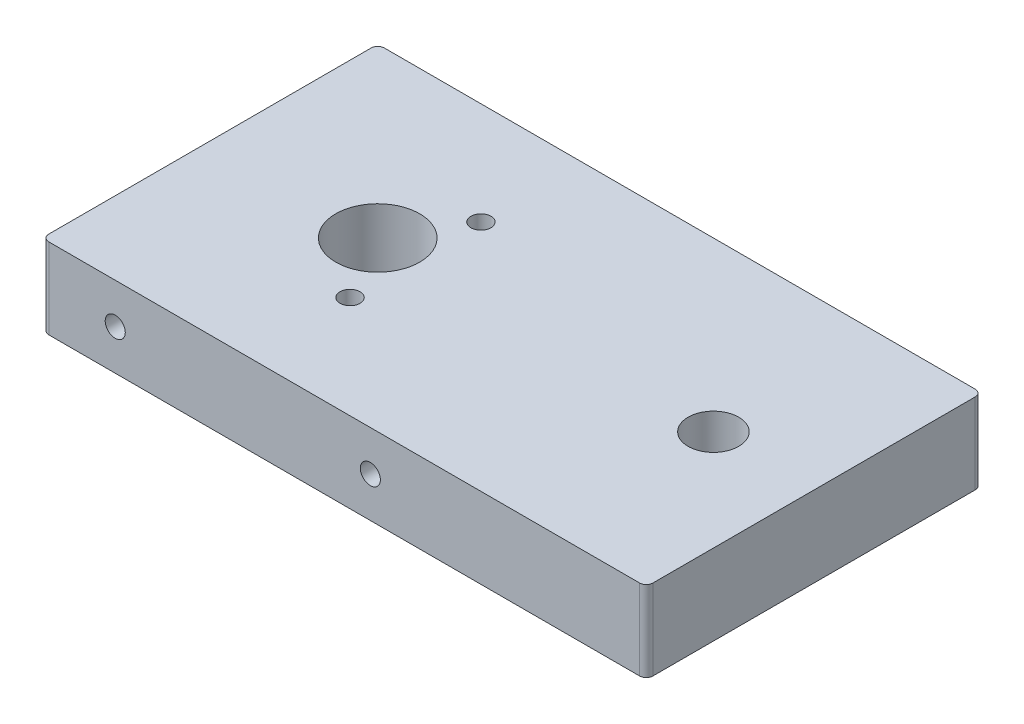
ISO-10303-21;
HEADER;
FILE_DESCRIPTION(('STEP AP214'),'2;1');
FILE_NAME('part.step','',(''),(''),'','','');
FILE_SCHEMA(('AUTOMOTIVE_DESIGN { 1 0 10303 214 1 1 1 1 }'));
ENDSEC;
DATA;
#1=APPLICATION_CONTEXT('core data for automotive mechanical design processes');
#2=APPLICATION_PROTOCOL_DEFINITION('international standard','automotive_design',2000,#1);
#3=PRODUCT_CONTEXT('',#1,'mechanical');
#4=PRODUCT('Part','Part','',(#3));
#5=PRODUCT_RELATED_PRODUCT_CATEGORY('part','',(#4));
#6=PRODUCT_DEFINITION_FORMATION('','',#4);
#7=PRODUCT_DEFINITION_CONTEXT('part definition',#1,'design');
#8=PRODUCT_DEFINITION('design','',#6,#7);
#9=PRODUCT_DEFINITION_SHAPE('','',#8);
#10=(LENGTH_UNIT() NAMED_UNIT(*) SI_UNIT(.MILLI.,.METRE.));
#11=(NAMED_UNIT(*) PLANE_ANGLE_UNIT() SI_UNIT($,.RADIAN.));
#12=(NAMED_UNIT(*) SI_UNIT($,.STERADIAN.) SOLID_ANGLE_UNIT());
#13=UNCERTAINTY_MEASURE_WITH_UNIT(LENGTH_MEASURE(1.E-05),#10,'distance_accuracy_value','');
#14=(GEOMETRIC_REPRESENTATION_CONTEXT(3) GLOBAL_UNCERTAINTY_ASSIGNED_CONTEXT((#13)) GLOBAL_UNIT_ASSIGNED_CONTEXT((#10,
#11,#12)) REPRESENTATION_CONTEXT('',''));
#15=CARTESIAN_POINT('',(0.,0.,0.));
#16=DIRECTION('',(0.,0.,1.));
#17=DIRECTION('',(1.,0.,0.));
#18=AXIS2_PLACEMENT_3D('',#15,#16,#17);
#19=CARTESIAN_POINT('',(50.8,15.24,-31.75));
#20=DIRECTION('',(1.,0.,0.));
#21=DIRECTION('',(0.,0.,-1.));
#22=AXIS2_PLACEMENT_3D('',#19,#20,#21);
#23=PLANE('',#22);
#24=DIRECTION('',(0.,0.,1.));
#25=VECTOR('',#24,1.);
#26=CARTESIAN_POINT('',(50.8,15.24,-31.75));
#27=LINE('',#26,#25);
#28=CARTESIAN_POINT('',(50.8,15.24,-30.48));
#29=VERTEX_POINT('',#28);
#30=CARTESIAN_POINT('',(50.8,15.24,30.48));
#31=VERTEX_POINT('',#30);
#32=EDGE_CURVE('E206',#29,#31,#27,.T.);
#33=ORIENTED_EDGE('',*,*,#32,.T.);
#34=DIRECTION('',(0.,-1.,0.));
#35=VECTOR('',#34,1.);
#36=CARTESIAN_POINT('',(50.8,15.24,30.48));
#37=LINE('',#36,#35);
#38=CARTESIAN_POINT('',(50.8,0.,30.48));
#39=VERTEX_POINT('',#38);
#40=EDGE_CURVE('E237',#31,#39,#37,.T.);
#41=ORIENTED_EDGE('',*,*,#40,.T.);
#42=DIRECTION('',(0.,0.,1.));
#43=VECTOR('',#42,1.);
#44=CARTESIAN_POINT('',(50.8,0.,-31.75));
#45=LINE('',#44,#43);
#46=CARTESIAN_POINT('',(50.8,0.,-30.48));
#47=VERTEX_POINT('',#46);
#48=EDGE_CURVE('E205',#47,#39,#45,.T.);
#49=ORIENTED_EDGE('',*,*,#48,.F.);
#50=DIRECTION('',(0.,-1.,0.));
#51=VECTOR('',#50,1.);
#52=CARTESIAN_POINT('',(50.8,15.24,-30.48));
#53=LINE('',#52,#51);
#54=EDGE_CURVE('E221',#47,#29,#53,.F.);
#55=ORIENTED_EDGE('',*,*,#54,.T.);
#56=EDGE_LOOP('',(#33,#41,#49,#55));
#57=FACE_BOUND('',#56,.T.);
#58=ADVANCED_FACE('F46',(#57),#23,.T.);
#59=CARTESIAN_POINT('',(50.8,15.24,-31.75));
#60=DIRECTION('',(0.,0.,1.));
#61=DIRECTION('',(1.,0.,0.));
#62=AXIS2_PLACEMENT_3D('',#59,#60,#61);
#63=PLANE('',#62);
#64=CARTESIAN_POINT('',(-49.657,7.62,-31.75));
#65=DIRECTION('',(0.,0.,-1.));
#66=DIRECTION('',(-1.,0.,0.));
#67=AXIS2_PLACEMENT_3D('',#64,#65,#66);
#68=CIRCLE('',#67,1.89864999999999);
#69=CARTESIAN_POINT('',(-51.55565,7.62,-31.75));
#70=VERTEX_POINT('',#69);
#71=EDGE_CURVE('E149',#70,#70,#68,.T.);
#72=ORIENTED_EDGE('',*,*,#71,.F.);
#73=EDGE_LOOP('',(#72));
#74=FACE_BOUND('',#73,.T.);
#75=CARTESIAN_POINT('',(-1.39700000000001,7.62,-31.75));
#76=DIRECTION('',(0.,0.,-1.));
#77=DIRECTION('',(-1.,0.,0.));
#78=AXIS2_PLACEMENT_3D('',#75,#76,#77);
#79=CIRCLE('',#78,1.89864999999999);
#80=CARTESIAN_POINT('',(-3.29565,7.62,-31.75));
#81=VERTEX_POINT('',#80);
#82=EDGE_CURVE('E157',#81,#81,#79,.T.);
#83=ORIENTED_EDGE('',*,*,#82,.F.);
#84=EDGE_LOOP('',(#83));
#85=FACE_BOUND('',#84,.T.);
#86=DIRECTION('',(-1.,0.,0.));
#87=VECTOR('',#86,1.);
#88=CARTESIAN_POINT('',(50.8,15.24,-31.75));
#89=LINE('',#88,#87);
#90=CARTESIAN_POINT('',(49.53,15.24,-31.75));
#91=VERTEX_POINT('',#90);
#92=CARTESIAN_POINT('',(-62.23,15.24,-31.75));
#93=VERTEX_POINT('',#92);
#94=EDGE_CURVE('E218',#91,#93,#89,.T.);
#95=ORIENTED_EDGE('',*,*,#94,.F.);
#96=DIRECTION('',(0.,-1.,0.));
#97=VECTOR('',#96,1.);
#98=CARTESIAN_POINT('',(49.53,0.,-31.75));
#99=LINE('',#98,#97);
#100=CARTESIAN_POINT('',(49.53,0.,-31.75));
#101=VERTEX_POINT('',#100);
#102=EDGE_CURVE('E274',#91,#101,#99,.T.);
#103=ORIENTED_EDGE('',*,*,#102,.T.);
#104=DIRECTION('',(-1.,0.,0.));
#105=VECTOR('',#104,1.);
#106=CARTESIAN_POINT('',(50.8,0.,-31.75));
#107=LINE('',#106,#105);
#108=CARTESIAN_POINT('',(-62.23,0.,-31.75));
#109=VERTEX_POINT('',#108);
#110=EDGE_CURVE('E211',#101,#109,#107,.T.);
#111=ORIENTED_EDGE('',*,*,#110,.T.);
#112=DIRECTION('',(0.,-1.,0.));
#113=VECTOR('',#112,1.);
#114=CARTESIAN_POINT('',(-62.23,15.24,-31.75));
#115=LINE('',#114,#113);
#116=EDGE_CURVE('E271',#109,#93,#115,.F.);
#117=ORIENTED_EDGE('',*,*,#116,.T.);
#118=EDGE_LOOP('',(#95,#103,#111,#117));
#119=FACE_BOUND('',#118,.T.);
#120=ADVANCED_FACE('F310',(#74,#85,#119),#63,.F.);
#121=CARTESIAN_POINT('',(-63.5,15.24,-31.75));
#122=DIRECTION('',(1.,0.,0.));
#123=DIRECTION('',(0.,0.,-1.));
#124=AXIS2_PLACEMENT_3D('',#121,#122,#123);
#125=PLANE('',#124);
#126=DIRECTION('',(0.,0.,1.));
#127=VECTOR('',#126,1.);
#128=CARTESIAN_POINT('',(-63.5,15.24,-31.75));
#129=LINE('',#128,#127);
#130=CARTESIAN_POINT('',(-63.5,15.24,-30.48));
#131=VERTEX_POINT('',#130);
#132=CARTESIAN_POINT('',(-63.5,15.24,30.4800000000001));
#133=VERTEX_POINT('',#132);
#134=EDGE_CURVE('E215',#131,#133,#129,.T.);
#135=ORIENTED_EDGE('',*,*,#134,.F.);
#136=DIRECTION('',(0.,-1.,0.));
#137=VECTOR('',#136,1.);
#138=CARTESIAN_POINT('',(-63.5,15.24,-30.48));
#139=LINE('',#138,#137);
#140=CARTESIAN_POINT('',(-63.5,0.,-30.48));
#141=VERTEX_POINT('',#140);
#142=EDGE_CURVE('E11',#131,#141,#139,.T.);
#143=ORIENTED_EDGE('',*,*,#142,.T.);
#144=DIRECTION('',(0.,0.,1.));
#145=VECTOR('',#144,1.);
#146=CARTESIAN_POINT('',(-63.5,0.,-31.75));
#147=LINE('',#146,#145);
#148=CARTESIAN_POINT('',(-63.5,0.,30.4800000000001));
#149=VERTEX_POINT('',#148);
#150=EDGE_CURVE('E229',#141,#149,#147,.T.);
#151=ORIENTED_EDGE('',*,*,#150,.T.);
#152=DIRECTION('',(0.,-1.,0.));
#153=VECTOR('',#152,1.);
#154=CARTESIAN_POINT('',(-63.5,15.24,30.4800000000001));
#155=LINE('',#154,#153);
#156=EDGE_CURVE('E55',#149,#133,#155,.F.);
#157=ORIENTED_EDGE('',*,*,#156,.T.);
#158=EDGE_LOOP('',(#135,#143,#151,#157));
#159=FACE_BOUND('',#158,.T.);
#160=ADVANCED_FACE('F321',(#159),#125,.F.);
#161=CARTESIAN_POINT('',(50.8,15.24,31.75));
#162=DIRECTION('',(0.,0.,1.));
#163=DIRECTION('',(1.,0.,0.));
#164=AXIS2_PLACEMENT_3D('',#161,#162,#163);
#165=PLANE('',#164);
#166=CARTESIAN_POINT('',(-49.657,7.62,31.75));
#167=DIRECTION('',(0.,0.,1.));
#168=DIRECTION('',(1.,0.,0.));
#169=AXIS2_PLACEMENT_3D('',#166,#167,#168);
#170=CIRCLE('',#169,1.89864999999999);
#171=CARTESIAN_POINT('',(-47.75835,7.62,31.75));
#172=VERTEX_POINT('',#171);
#173=EDGE_CURVE('E135',#172,#172,#170,.T.);
#174=ORIENTED_EDGE('',*,*,#173,.F.);
#175=EDGE_LOOP('',(#174));
#176=FACE_BOUND('',#175,.T.);
#177=CARTESIAN_POINT('',(-1.39699999999999,7.62,31.75));
#178=DIRECTION('',(0.,0.,1.));
#179=DIRECTION('',(1.,0.,0.));
#180=AXIS2_PLACEMENT_3D('',#177,#178,#179);
#181=CIRCLE('',#180,1.89864999999999);
#182=CARTESIAN_POINT('',(0.501649999999998,7.62,31.75));
#183=VERTEX_POINT('',#182);
#184=EDGE_CURVE('E134',#183,#183,#181,.T.);
#185=ORIENTED_EDGE('',*,*,#184,.F.);
#186=EDGE_LOOP('',(#185));
#187=FACE_BOUND('',#186,.T.);
#188=DIRECTION('',(-1.,0.,0.));
#189=VECTOR('',#188,1.);
#190=CARTESIAN_POINT('',(50.8,0.,31.75));
#191=LINE('',#190,#189);
#192=CARTESIAN_POINT('',(49.53,0.,31.75));
#193=VERTEX_POINT('',#192);
#194=CARTESIAN_POINT('',(-62.23,0.,31.75));
#195=VERTEX_POINT('',#194);
#196=EDGE_CURVE('E225',#193,#195,#191,.T.);
#197=ORIENTED_EDGE('',*,*,#196,.F.);
#198=DIRECTION('',(0.,-1.,0.));
#199=VECTOR('',#198,1.);
#200=CARTESIAN_POINT('',(49.53,15.24,31.75));
#201=LINE('',#200,#199);
#202=CARTESIAN_POINT('',(49.53,15.24,31.75));
#203=VERTEX_POINT('',#202);
#204=EDGE_CURVE('E257',#193,#203,#201,.F.);
#205=ORIENTED_EDGE('',*,*,#204,.T.);
#206=DIRECTION('',(-1.,0.,0.));
#207=VECTOR('',#206,1.);
#208=CARTESIAN_POINT('',(50.8,15.24,31.75));
#209=LINE('',#208,#207);
#210=CARTESIAN_POINT('',(-62.23,15.24,31.75));
#211=VERTEX_POINT('',#210);
#212=EDGE_CURVE('E210',#203,#211,#209,.T.);
#213=ORIENTED_EDGE('',*,*,#212,.T.);
#214=DIRECTION('',(0.,-1.,0.));
#215=VECTOR('',#214,1.);
#216=CARTESIAN_POINT('',(-62.23,0.,31.75));
#217=LINE('',#216,#215);
#218=EDGE_CURVE('E253',#211,#195,#217,.T.);
#219=ORIENTED_EDGE('',*,*,#218,.T.);
#220=EDGE_LOOP('',(#197,#205,#213,#219));
#221=FACE_BOUND('',#220,.T.);
#222=ADVANCED_FACE('F329',(#176,#187,#221),#165,.T.);
#223=CARTESIAN_POINT('',(0.,15.24,0.));
#224=DIRECTION('',(0.,-1.,0.));
#225=DIRECTION('',(0.,0.,-1.));
#226=AXIS2_PLACEMENT_3D('',#223,#224,#225);
#227=PLANE('',#226);
#228=CARTESIAN_POINT('',(31.75,15.24,0.));
#229=DIRECTION('',(0.,-1.,0.));
#230=DIRECTION('',(0.,0.,-1.));
#231=AXIS2_PLACEMENT_3D('',#228,#229,#230);
#232=CIRCLE('',#231,4.7879);
#233=CARTESIAN_POINT('',(31.75,15.24,-4.7879));
#234=VERTEX_POINT('',#233);
#235=EDGE_CURVE('E177',#234,#234,#232,.T.);
#236=ORIENTED_EDGE('',*,*,#235,.T.);
#237=EDGE_LOOP('',(#236));
#238=FACE_BOUND('',#237,.T.);
#239=CARTESIAN_POINT('',(-24.60625,15.24,-12.3733379565702));
#240=DIRECTION('',(0.,1.,0.));
#241=DIRECTION('',(0.,0.,1.));
#242=AXIS2_PLACEMENT_3D('',#239,#240,#241);
#243=CIRCLE('',#242,1.89865);
#244=CARTESIAN_POINT('',(-24.60625,15.24,-10.4746879565702));
#245=VERTEX_POINT('',#244);
#246=EDGE_CURVE('E181',#245,#245,#243,.T.);
#247=ORIENTED_EDGE('',*,*,#246,.F.);
#248=EDGE_LOOP('',(#247));
#249=FACE_BOUND('',#248,.T.);
#250=CARTESIAN_POINT('',(-24.60625,15.24,12.3733379565702));
#251=DIRECTION('',(0.,1.,0.));
#252=DIRECTION('',(0.,0.,1.));
#253=AXIS2_PLACEMENT_3D('',#250,#251,#252);
#254=CIRCLE('',#253,1.89865);
#255=CARTESIAN_POINT('',(-24.60625,15.24,14.2719879565702));
#256=VERTEX_POINT('',#255);
#257=EDGE_CURVE('E189',#256,#256,#254,.T.);
#258=ORIENTED_EDGE('',*,*,#257,.F.);
#259=EDGE_LOOP('',(#258));
#260=FACE_BOUND('',#259,.T.);
#261=CARTESIAN_POINT('',(-31.75,15.24,0.));
#262=DIRECTION('',(0.,1.,0.));
#263=DIRECTION('',(0.,0.,1.));
#264=AXIS2_PLACEMENT_3D('',#261,#262,#263);
#265=CIRCLE('',#264,7.93749999999999);
#266=CARTESIAN_POINT('',(-31.75,15.24,7.93749999999999));
#267=VERTEX_POINT('',#266);
#268=EDGE_CURVE('E197',#267,#267,#265,.T.);
#269=ORIENTED_EDGE('',*,*,#268,.F.);
#270=EDGE_LOOP('',(#269));
#271=FACE_BOUND('',#270,.T.);
#272=ORIENTED_EDGE('',*,*,#212,.F.);
#273=CARTESIAN_POINT('',(49.53,15.24,30.48));
#274=DIRECTION('',(0.,-1.,0.));
#275=DIRECTION('',(0.,0.,-1.));
#276=AXIS2_PLACEMENT_3D('',#273,#274,#275);
#277=CIRCLE('',#276,1.27);
#278=EDGE_CURVE('E268',#203,#31,#277,.F.);
#279=ORIENTED_EDGE('',*,*,#278,.T.);
#280=ORIENTED_EDGE('',*,*,#32,.F.);
#281=CARTESIAN_POINT('',(49.53,15.24,-30.48));
#282=DIRECTION('',(0.,-1.,0.));
#283=DIRECTION('',(0.,0.,-1.));
#284=AXIS2_PLACEMENT_3D('',#281,#282,#283);
#285=CIRCLE('',#284,1.27);
#286=EDGE_CURVE('E265',#29,#91,#285,.F.);
#287=ORIENTED_EDGE('',*,*,#286,.T.);
#288=ORIENTED_EDGE('',*,*,#94,.T.);
#289=CARTESIAN_POINT('',(-62.23,15.24,-30.48));
#290=DIRECTION('',(0.,-1.,0.));
#291=DIRECTION('',(0.,0.,-1.));
#292=AXIS2_PLACEMENT_3D('',#289,#290,#291);
#293=CIRCLE('',#292,1.27);
#294=EDGE_CURVE('E68',#93,#131,#293,.F.);
#295=ORIENTED_EDGE('',*,*,#294,.T.);
#296=ORIENTED_EDGE('',*,*,#134,.T.);
#297=CARTESIAN_POINT('',(-62.23,15.24,30.4800000000001));
#298=DIRECTION('',(0.,-1.,0.));
#299=DIRECTION('',(0.,0.,-1.));
#300=AXIS2_PLACEMENT_3D('',#297,#298,#299);
#301=CIRCLE('',#300,1.27);
#302=EDGE_CURVE('E260',#133,#211,#301,.F.);
#303=ORIENTED_EDGE('',*,*,#302,.T.);
#304=EDGE_LOOP('',(#272,#279,#280,#287,#288,#295,#296,#303));
#305=FACE_BOUND('',#304,.T.);
#306=ADVANCED_FACE('F324',(#238,#249,#260,#271,#305),#227,.F.);
#307=CARTESIAN_POINT('',(0.,0.,0.));
#308=DIRECTION('',(0.,-1.,0.));
#309=DIRECTION('',(0.,0.,-1.));
#310=AXIS2_PLACEMENT_3D('',#307,#308,#309);
#311=PLANE('',#310);
#312=CARTESIAN_POINT('',(31.75,0.,0.));
#313=DIRECTION('',(0.,-1.,0.));
#314=DIRECTION('',(0.,0.,-1.));
#315=AXIS2_PLACEMENT_3D('',#312,#313,#314);
#316=CIRCLE('',#315,9.52499999999999);
#317=CARTESIAN_POINT('',(31.75,0.,-9.52499999999999));
#318=VERTEX_POINT('',#317);
#319=EDGE_CURVE('E165',#318,#318,#316,.T.);
#320=ORIENTED_EDGE('',*,*,#319,.F.);
#321=EDGE_LOOP('',(#320));
#322=FACE_BOUND('',#321,.T.);
#323=CARTESIAN_POINT('',(-24.60625,0.,-12.3733379565702));
#324=DIRECTION('',(0.,1.,0.));
#325=DIRECTION('',(0.,0.,1.));
#326=AXIS2_PLACEMENT_3D('',#323,#324,#325);
#327=CIRCLE('',#326,1.89864999999999);
#328=CARTESIAN_POINT('',(-24.60625,0.,-10.4746879565702));
#329=VERTEX_POINT('',#328);
#330=EDGE_CURVE('E185',#329,#329,#327,.T.);
#331=ORIENTED_EDGE('',*,*,#330,.T.);
#332=EDGE_LOOP('',(#331));
#333=FACE_BOUND('',#332,.T.);
#334=CARTESIAN_POINT('',(-24.60625,0.,12.3733379565702));
#335=DIRECTION('',(0.,1.,0.));
#336=DIRECTION('',(0.,0.,1.));
#337=AXIS2_PLACEMENT_3D('',#334,#335,#336);
#338=CIRCLE('',#337,1.89864999999999);
#339=CARTESIAN_POINT('',(-24.60625,0.,14.2719879565702));
#340=VERTEX_POINT('',#339);
#341=EDGE_CURVE('E193',#340,#340,#338,.T.);
#342=ORIENTED_EDGE('',*,*,#341,.T.);
#343=EDGE_LOOP('',(#342));
#344=FACE_BOUND('',#343,.T.);
#345=CARTESIAN_POINT('',(-31.75,0.,0.));
#346=DIRECTION('',(0.,1.,0.));
#347=DIRECTION('',(0.,0.,1.));
#348=AXIS2_PLACEMENT_3D('',#345,#346,#347);
#349=CIRCLE('',#348,7.9375);
#350=CARTESIAN_POINT('',(-31.75,0.,7.9375));
#351=VERTEX_POINT('',#350);
#352=EDGE_CURVE('E201',#351,#351,#349,.T.);
#353=ORIENTED_EDGE('',*,*,#352,.T.);
#354=EDGE_LOOP('',(#353));
#355=FACE_BOUND('',#354,.T.);
#356=ORIENTED_EDGE('',*,*,#48,.T.);
#357=CARTESIAN_POINT('',(49.53,0.,30.48));
#358=DIRECTION('',(0.,-1.,0.));
#359=DIRECTION('',(0.,0.,-1.));
#360=AXIS2_PLACEMENT_3D('',#357,#358,#359);
#361=CIRCLE('',#360,1.27);
#362=EDGE_CURVE('E250',#39,#193,#361,.T.);
#363=ORIENTED_EDGE('',*,*,#362,.T.);
#364=ORIENTED_EDGE('',*,*,#196,.T.);
#365=CARTESIAN_POINT('',(-62.23,0.,30.4800000000001));
#366=DIRECTION('',(0.,-1.,0.));
#367=DIRECTION('',(0.,0.,-1.));
#368=AXIS2_PLACEMENT_3D('',#365,#366,#367);
#369=CIRCLE('',#368,1.27);
#370=EDGE_CURVE('E241',#195,#149,#369,.T.);
#371=ORIENTED_EDGE('',*,*,#370,.T.);
#372=ORIENTED_EDGE('',*,*,#150,.F.);
#373=CARTESIAN_POINT('',(-62.23,0.,-30.48));
#374=DIRECTION('',(0.,-1.,0.));
#375=DIRECTION('',(0.,0.,-1.));
#376=AXIS2_PLACEMENT_3D('',#373,#374,#375);
#377=CIRCLE('',#376,1.27);
#378=EDGE_CURVE('E244',#141,#109,#377,.T.);
#379=ORIENTED_EDGE('',*,*,#378,.T.);
#380=ORIENTED_EDGE('',*,*,#110,.F.);
#381=CARTESIAN_POINT('',(49.53,0.,-30.48));
#382=DIRECTION('',(0.,-1.,0.));
#383=DIRECTION('',(0.,0.,-1.));
#384=AXIS2_PLACEMENT_3D('',#381,#382,#383);
#385=CIRCLE('',#384,1.27);
#386=EDGE_CURVE('E247',#101,#47,#385,.T.);
#387=ORIENTED_EDGE('',*,*,#386,.T.);
#388=EDGE_LOOP('',(#356,#363,#364,#371,#372,#379,#380,#387));
#389=FACE_BOUND('',#388,.T.);
#390=ADVANCED_FACE('F315',(#322,#333,#344,#355,#389),#311,.T.);
#391=CARTESIAN_POINT('',(-31.75,15.24,0.));
#392=DIRECTION('',(0.,1.,0.));
#393=DIRECTION('',(0.,0.,1.));
#394=AXIS2_PLACEMENT_3D('',#391,#392,#393);
#395=CYLINDRICAL_SURFACE('',#394,7.93749999999999);
#396=ORIENTED_EDGE('',*,*,#352,.F.);
#397=EDGE_LOOP('',(#396));
#398=FACE_BOUND('',#397,.T.);
#399=ORIENTED_EDGE('',*,*,#268,.T.);
#400=EDGE_LOOP('',(#399));
#401=FACE_BOUND('',#400,.T.);
#402=ADVANCED_FACE('F361',(#398,#401),#395,.F.);
#403=CARTESIAN_POINT('',(-24.60625,15.24,12.3733379565702));
#404=DIRECTION('',(0.,1.,0.));
#405=DIRECTION('',(0.,0.,1.));
#406=AXIS2_PLACEMENT_3D('',#403,#404,#405);
#407=CYLINDRICAL_SURFACE('',#406,1.89865);
#408=ORIENTED_EDGE('',*,*,#341,.F.);
#409=EDGE_LOOP('',(#408));
#410=FACE_BOUND('',#409,.T.);
#411=ORIENTED_EDGE('',*,*,#257,.T.);
#412=EDGE_LOOP('',(#411));
#413=FACE_BOUND('',#412,.T.);
#414=ADVANCED_FACE('F368',(#410,#413),#407,.F.);
#415=CARTESIAN_POINT('',(-24.60625,15.24,-12.3733379565702));
#416=DIRECTION('',(0.,1.,0.));
#417=DIRECTION('',(0.,0.,1.));
#418=AXIS2_PLACEMENT_3D('',#415,#416,#417);
#419=CYLINDRICAL_SURFACE('',#418,1.89865);
#420=ORIENTED_EDGE('',*,*,#330,.F.);
#421=EDGE_LOOP('',(#420));
#422=FACE_BOUND('',#421,.T.);
#423=ORIENTED_EDGE('',*,*,#246,.T.);
#424=EDGE_LOOP('',(#423));
#425=FACE_BOUND('',#424,.T.);
#426=ADVANCED_FACE('F372',(#422,#425),#419,.F.);
#427=CARTESIAN_POINT('',(31.75,0.,0.));
#428=DIRECTION('',(0.,-1.,0.));
#429=DIRECTION('',(0.,0.,-1.));
#430=AXIS2_PLACEMENT_3D('',#427,#428,#429);
#431=CYLINDRICAL_SURFACE('',#430,4.7879);
#432=ORIENTED_EDGE('',*,*,#235,.F.);
#433=EDGE_LOOP('',(#432));
#434=FACE_BOUND('',#433,.T.);
#435=CARTESIAN_POINT('',(31.75,7.62,0.));
#436=DIRECTION('',(0.,-1.,0.));
#437=DIRECTION('',(0.,0.,-1.));
#438=AXIS2_PLACEMENT_3D('',#435,#436,#437);
#439=CIRCLE('',#438,4.7879);
#440=CARTESIAN_POINT('',(31.75,7.62,-4.7879));
#441=VERTEX_POINT('',#440);
#442=EDGE_CURVE('E173',#441,#441,#439,.T.);
#443=ORIENTED_EDGE('',*,*,#442,.T.);
#444=EDGE_LOOP('',(#443));
#445=FACE_BOUND('',#444,.T.);
#446=ADVANCED_FACE('F376',(#434,#445),#431,.F.);
#447=CARTESIAN_POINT('',(36.5379,7.62,0.));
#448=DIRECTION('',(0.,1.,0.));
#449=DIRECTION('',(0.,0.,1.));
#450=AXIS2_PLACEMENT_3D('',#447,#448,#449);
#451=PLANE('',#450);
#452=ORIENTED_EDGE('',*,*,#442,.F.);
#453=EDGE_LOOP('',(#452));
#454=FACE_BOUND('',#453,.T.);
#455=CARTESIAN_POINT('',(31.75,7.62,0.));
#456=DIRECTION('',(0.,-1.,0.));
#457=DIRECTION('',(0.,0.,-1.));
#458=AXIS2_PLACEMENT_3D('',#455,#456,#457);
#459=CIRCLE('',#458,9.525);
#460=CARTESIAN_POINT('',(31.75,7.62,-9.525));
#461=VERTEX_POINT('',#460);
#462=EDGE_CURVE('E169',#461,#461,#459,.T.);
#463=ORIENTED_EDGE('',*,*,#462,.T.);
#464=EDGE_LOOP('',(#463));
#465=FACE_BOUND('',#464,.T.);
#466=ADVANCED_FACE('F380',(#454,#465),#451,.F.);
#467=CARTESIAN_POINT('',(31.75,0.,0.));
#468=DIRECTION('',(0.,-1.,0.));
#469=DIRECTION('',(0.,0.,-1.));
#470=AXIS2_PLACEMENT_3D('',#467,#468,#469);
#471=CYLINDRICAL_SURFACE('',#470,9.525);
#472=ORIENTED_EDGE('',*,*,#462,.F.);
#473=EDGE_LOOP('',(#472));
#474=FACE_BOUND('',#473,.T.);
#475=ORIENTED_EDGE('',*,*,#319,.T.);
#476=EDGE_LOOP('',(#475));
#477=FACE_BOUND('',#476,.T.);
#478=ADVANCED_FACE('F384',(#474,#477),#471,.F.);
#479=CARTESIAN_POINT('',(-1.39700000000001,7.62,-21.7148240143166));
#480=DIRECTION('',(0.,0.,-1.));
#481=DIRECTION('',(-1.,0.,0.));
#482=AXIS2_PLACEMENT_3D('',#479,#480,#481);
#483=CONICAL_SURFACE('',#482,1.89865,1.02974425867665);
#484=CARTESIAN_POINT('',(-1.39700000000001,7.62,-20.574));
#485=VERTEX_POINT('',#484);
#486=VERTEX_LOOP('',#485);
#487=FACE_BOUND('',#486,.T.);
#488=CARTESIAN_POINT('',(-1.39700000000001,7.62,-21.7148240143166));
#489=DIRECTION('',(0.,0.,-1.));
#490=DIRECTION('',(-1.,0.,0.));
#491=AXIS2_PLACEMENT_3D('',#488,#489,#490);
#492=CIRCLE('',#491,1.89865);
#493=CARTESIAN_POINT('',(-3.29565000000001,7.62,-21.7148240143166));
#494=VERTEX_POINT('',#493);
#495=EDGE_CURVE('E161',#494,#494,#492,.T.);
#496=ORIENTED_EDGE('',*,*,#495,.T.);
#497=EDGE_LOOP('',(#496));
#498=FACE_BOUND('',#497,.T.);
#499=ADVANCED_FACE('F388',(#487,#498),#483,.F.);
#500=CARTESIAN_POINT('',(-1.39700000000001,7.62,-31.75));
#501=DIRECTION('',(0.,0.,-1.));
#502=DIRECTION('',(-1.,0.,0.));
#503=AXIS2_PLACEMENT_3D('',#500,#501,#502);
#504=CYLINDRICAL_SURFACE('',#503,1.89864999999999);
#505=ORIENTED_EDGE('',*,*,#495,.F.);
#506=EDGE_LOOP('',(#505));
#507=FACE_BOUND('',#506,.T.);
#508=ORIENTED_EDGE('',*,*,#82,.T.);
#509=EDGE_LOOP('',(#508));
#510=FACE_BOUND('',#509,.T.);
#511=ADVANCED_FACE('F392',(#507,#510),#504,.F.);
#512=CARTESIAN_POINT('',(-49.657,7.62,-21.7148240143166));
#513=DIRECTION('',(0.,0.,-1.));
#514=DIRECTION('',(-1.,0.,0.));
#515=AXIS2_PLACEMENT_3D('',#512,#513,#514);
#516=CONICAL_SURFACE('',#515,1.89864999999999,1.02974425867665);
#517=CARTESIAN_POINT('',(-49.657,7.62,-20.574));
#518=VERTEX_POINT('',#517);
#519=VERTEX_LOOP('',#518);
#520=FACE_BOUND('',#519,.T.);
#521=CARTESIAN_POINT('',(-49.657,7.62,-21.7148240143166));
#522=DIRECTION('',(0.,0.,-1.));
#523=DIRECTION('',(-1.,0.,0.));
#524=AXIS2_PLACEMENT_3D('',#521,#522,#523);
#525=CIRCLE('',#524,1.89864999999999);
#526=CARTESIAN_POINT('',(-51.55565,7.62,-21.7148240143166));
#527=VERTEX_POINT('',#526);
#528=EDGE_CURVE('E153',#527,#527,#525,.T.);
#529=ORIENTED_EDGE('',*,*,#528,.T.);
#530=EDGE_LOOP('',(#529));
#531=FACE_BOUND('',#530,.T.);
#532=ADVANCED_FACE('F396',(#520,#531),#516,.F.);
#533=CARTESIAN_POINT('',(-49.657,7.62,-31.75));
#534=DIRECTION('',(0.,0.,-1.));
#535=DIRECTION('',(-1.,0.,0.));
#536=AXIS2_PLACEMENT_3D('',#533,#534,#535);
#537=CYLINDRICAL_SURFACE('',#536,1.89864999999999);
#538=ORIENTED_EDGE('',*,*,#528,.F.);
#539=EDGE_LOOP('',(#538));
#540=FACE_BOUND('',#539,.T.);
#541=ORIENTED_EDGE('',*,*,#71,.T.);
#542=EDGE_LOOP('',(#541));
#543=FACE_BOUND('',#542,.T.);
#544=ADVANCED_FACE('F400',(#540,#543),#537,.F.);
#545=CARTESIAN_POINT('',(-1.39699999999999,7.62,21.7148240143167));
#546=DIRECTION('',(0.,0.,1.));
#547=DIRECTION('',(1.,0.,0.));
#548=AXIS2_PLACEMENT_3D('',#545,#546,#547);
#549=CONICAL_SURFACE('',#548,1.89865,1.02974425867665);
#550=CARTESIAN_POINT('',(-1.39699999999999,7.62,20.574));
#551=VERTEX_POINT('',#550);
#552=VERTEX_LOOP('',#551);
#553=FACE_BOUND('',#552,.T.);
#554=CARTESIAN_POINT('',(-1.39699999999999,7.62,21.7148240143167));
#555=DIRECTION('',(0.,0.,1.));
#556=DIRECTION('',(1.,0.,0.));
#557=AXIS2_PLACEMENT_3D('',#554,#555,#556);
#558=CIRCLE('',#557,1.89865);
#559=CARTESIAN_POINT('',(0.501650000000005,7.62,21.7148240143167));
#560=VERTEX_POINT('',#559);
#561=EDGE_CURVE('E141',#560,#560,#558,.T.);
#562=ORIENTED_EDGE('',*,*,#561,.T.);
#563=EDGE_LOOP('',(#562));
#564=FACE_BOUND('',#563,.T.);
#565=ADVANCED_FACE('F404',(#553,#564),#549,.F.);
#566=CARTESIAN_POINT('',(-1.39699999999999,7.62,31.75));
#567=DIRECTION('',(0.,0.,1.));
#568=DIRECTION('',(1.,0.,0.));
#569=AXIS2_PLACEMENT_3D('',#566,#567,#568);
#570=CYLINDRICAL_SURFACE('',#569,1.89864999999999);
#571=ORIENTED_EDGE('',*,*,#561,.F.);
#572=EDGE_LOOP('',(#571));
#573=FACE_BOUND('',#572,.T.);
#574=ORIENTED_EDGE('',*,*,#184,.T.);
#575=EDGE_LOOP('',(#574));
#576=FACE_BOUND('',#575,.T.);
#577=ADVANCED_FACE('F127',(#573,#576),#570,.F.);
#578=CARTESIAN_POINT('',(-49.657,7.62,21.7148240143167));
#579=DIRECTION('',(0.,0.,1.));
#580=DIRECTION('',(1.,0.,0.));
#581=AXIS2_PLACEMENT_3D('',#578,#579,#580);
#582=CONICAL_SURFACE('',#581,1.89864999999999,1.02974425867665);
#583=CARTESIAN_POINT('',(-49.657,7.62,20.574));
#584=VERTEX_POINT('',#583);
#585=VERTEX_LOOP('',#584);
#586=FACE_BOUND('',#585,.T.);
#587=CARTESIAN_POINT('',(-49.657,7.62,21.7148240143167));
#588=DIRECTION('',(0.,0.,1.));
#589=DIRECTION('',(1.,0.,0.));
#590=AXIS2_PLACEMENT_3D('',#587,#588,#589);
#591=CIRCLE('',#590,1.89864999999999);
#592=CARTESIAN_POINT('',(-47.75835,7.62,21.7148240143167));
#593=VERTEX_POINT('',#592);
#594=EDGE_CURVE('E131',#593,#593,#591,.T.);
#595=ORIENTED_EDGE('',*,*,#594,.T.);
#596=EDGE_LOOP('',(#595));
#597=FACE_BOUND('',#596,.T.);
#598=ADVANCED_FACE('F123',(#586,#597),#582,.F.);
#599=CARTESIAN_POINT('',(-49.657,7.62,31.75));
#600=DIRECTION('',(0.,0.,1.));
#601=DIRECTION('',(1.,0.,0.));
#602=AXIS2_PLACEMENT_3D('',#599,#600,#601);
#603=CYLINDRICAL_SURFACE('',#602,1.89864999999999);
#604=ORIENTED_EDGE('',*,*,#594,.F.);
#605=EDGE_LOOP('',(#604));
#606=FACE_BOUND('',#605,.T.);
#607=ORIENTED_EDGE('',*,*,#173,.T.);
#608=EDGE_LOOP('',(#607));
#609=FACE_BOUND('',#608,.T.);
#610=ADVANCED_FACE('F126',(#606,#609),#603,.F.);
#611=CARTESIAN_POINT('',(49.53,15.24,30.48));
#612=DIRECTION('',(0.,-1.,0.));
#613=DIRECTION('',(0.,0.,-1.));
#614=AXIS2_PLACEMENT_3D('',#611,#612,#613);
#615=CYLINDRICAL_SURFACE('',#614,1.27);
#616=ORIENTED_EDGE('',*,*,#278,.F.);
#617=ORIENTED_EDGE('',*,*,#204,.F.);
#618=ORIENTED_EDGE('',*,*,#362,.F.);
#619=ORIENTED_EDGE('',*,*,#40,.F.);
#620=EDGE_LOOP('',(#616,#617,#618,#619));
#621=FACE_BOUND('',#620,.T.);
#622=ADVANCED_FACE('F334',(#621),#615,.T.);
#623=CARTESIAN_POINT('',(49.53,15.24,-30.48));
#624=DIRECTION('',(0.,1.,0.));
#625=DIRECTION('',(0.,0.,1.));
#626=AXIS2_PLACEMENT_3D('',#623,#624,#625);
#627=CYLINDRICAL_SURFACE('',#626,1.27);
#628=ORIENTED_EDGE('',*,*,#286,.F.);
#629=ORIENTED_EDGE('',*,*,#54,.F.);
#630=ORIENTED_EDGE('',*,*,#386,.F.);
#631=ORIENTED_EDGE('',*,*,#102,.F.);
#632=EDGE_LOOP('',(#628,#629,#630,#631));
#633=FACE_BOUND('',#632,.T.);
#634=ADVANCED_FACE('F338',(#633),#627,.T.);
#635=CARTESIAN_POINT('',(-62.23,15.24,-30.48));
#636=DIRECTION('',(0.,-1.,0.));
#637=DIRECTION('',(0.,0.,-1.));
#638=AXIS2_PLACEMENT_3D('',#635,#636,#637);
#639=CYLINDRICAL_SURFACE('',#638,1.27);
#640=ORIENTED_EDGE('',*,*,#294,.F.);
#641=ORIENTED_EDGE('',*,*,#116,.F.);
#642=ORIENTED_EDGE('',*,*,#378,.F.);
#643=ORIENTED_EDGE('',*,*,#142,.F.);
#644=EDGE_LOOP('',(#640,#641,#642,#643));
#645=FACE_BOUND('',#644,.T.);
#646=ADVANCED_FACE('F320',(#645),#639,.T.);
#647=CARTESIAN_POINT('',(-62.23,15.24,30.4800000000001));
#648=DIRECTION('',(0.,1.,0.));
#649=DIRECTION('',(0.,0.,1.));
#650=AXIS2_PLACEMENT_3D('',#647,#648,#649);
#651=CYLINDRICAL_SURFACE('',#650,1.27);
#652=ORIENTED_EDGE('',*,*,#302,.F.);
#653=ORIENTED_EDGE('',*,*,#156,.F.);
#654=ORIENTED_EDGE('',*,*,#370,.F.);
#655=ORIENTED_EDGE('',*,*,#218,.F.);
#656=EDGE_LOOP('',(#652,#653,#654,#655));
#657=FACE_BOUND('',#656,.T.);
#658=ADVANCED_FACE('F48',(#657),#651,.T.);
#659=CLOSED_SHELL('',(#58,#120,#160,#222,#306,#390,#402,#414,#426,#446,#466,#478,#499,#511,#532,
#544,#565,#577,#598,#610,#622,#634,#646,#658));
#660=MANIFOLD_SOLID_BREP('B2',#659);
#661=ADVANCED_BREP_SHAPE_REPRESENTATION('',(#18,#660),#14);
#662=SHAPE_DEFINITION_REPRESENTATION(#9,#661);
ENDSEC;
END-ISO-10303-21;
